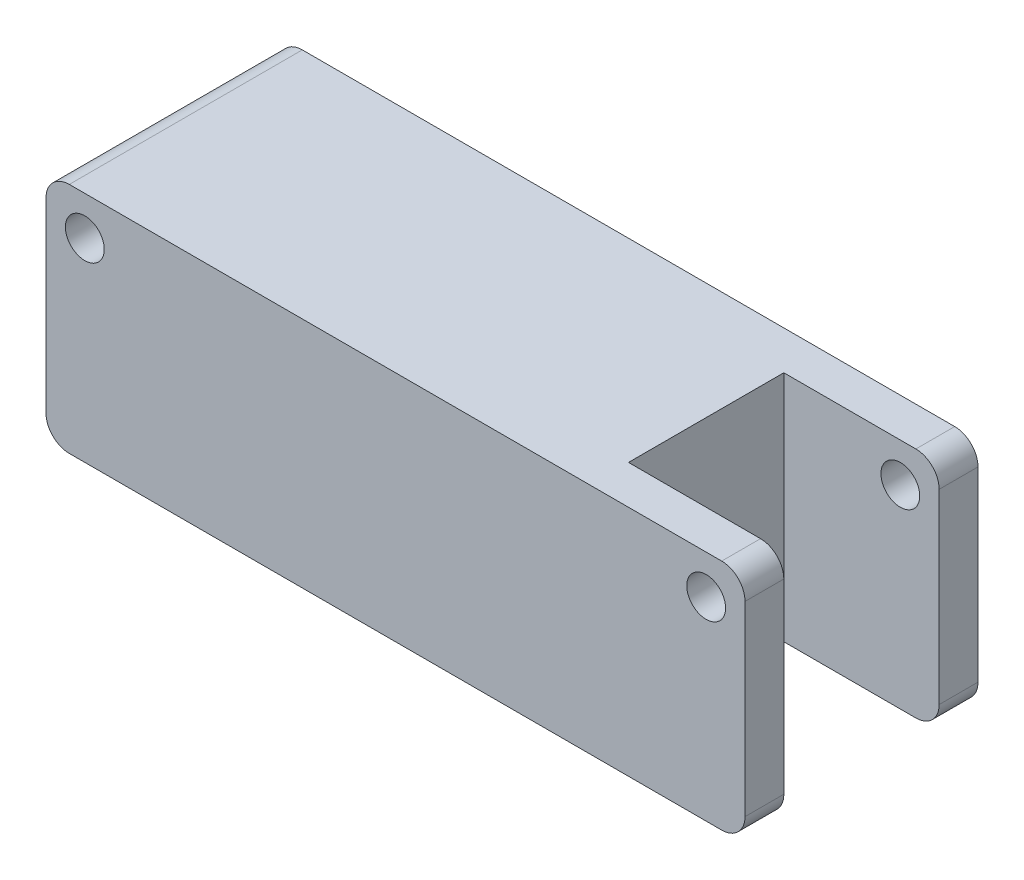
ISO-10303-21;
HEADER;
FILE_DESCRIPTION(('STEP AP214'),'2;1');
FILE_NAME('part.step','',(''),(''),'','','');
FILE_SCHEMA(('AUTOMOTIVE_DESIGN { 1 0 10303 214 1 1 1 1 }'));
ENDSEC;
DATA;
#1=APPLICATION_CONTEXT('core data for automotive mechanical design processes');
#2=APPLICATION_PROTOCOL_DEFINITION('international standard','automotive_design',2000,#1);
#3=PRODUCT_CONTEXT('',#1,'mechanical');
#4=PRODUCT('Part','Part','',(#3));
#5=PRODUCT_RELATED_PRODUCT_CATEGORY('part','',(#4));
#6=PRODUCT_DEFINITION_FORMATION('','',#4);
#7=PRODUCT_DEFINITION_CONTEXT('part definition',#1,'design');
#8=PRODUCT_DEFINITION('design','',#6,#7);
#9=PRODUCT_DEFINITION_SHAPE('','',#8);
#10=(LENGTH_UNIT() NAMED_UNIT(*) SI_UNIT(.MILLI.,.METRE.));
#11=(NAMED_UNIT(*) PLANE_ANGLE_UNIT() SI_UNIT($,.RADIAN.));
#12=(NAMED_UNIT(*) SI_UNIT($,.STERADIAN.) SOLID_ANGLE_UNIT());
#13=UNCERTAINTY_MEASURE_WITH_UNIT(LENGTH_MEASURE(1.E-05),#10,'distance_accuracy_value','');
#14=(GEOMETRIC_REPRESENTATION_CONTEXT(3) GLOBAL_UNCERTAINTY_ASSIGNED_CONTEXT((#13)) GLOBAL_UNIT_ASSIGNED_CONTEXT((#10,
#11,#12)) REPRESENTATION_CONTEXT('',''));
#15=CARTESIAN_POINT('',(0.,0.,0.));
#16=DIRECTION('',(0.,0.,1.));
#17=DIRECTION('',(1.,0.,0.));
#18=AXIS2_PLACEMENT_3D('',#15,#16,#17);
#19=CARTESIAN_POINT('',(90.,15.,15.));
#20=DIRECTION('',(-1.,0.,0.));
#21=DIRECTION('',(0.,0.,1.));
#22=AXIS2_PLACEMENT_3D('',#19,#20,#21);
#23=PLANE('',#22);
#24=DIRECTION('',(0.,0.,-1.));
#25=VECTOR('',#24,1.);
#26=CARTESIAN_POINT('',(90.,12.,15.));
#27=LINE('',#26,#25);
#28=CARTESIAN_POINT('',(90.,12.,-15.));
#29=VERTEX_POINT('',#28);
#30=CARTESIAN_POINT('',(90.,12.,-10.));
#31=VERTEX_POINT('',#30);
#32=EDGE_CURVE('E226',#29,#31,#27,.F.);
#33=ORIENTED_EDGE('',*,*,#32,.T.);
#34=DIRECTION('',(0.,1.,0.));
#35=VECTOR('',#34,1.);
#36=CARTESIAN_POINT('',(90.,-15.,-10.));
#37=LINE('',#36,#35);
#38=CARTESIAN_POINT('',(90.,-12.,-10.));
#39=VERTEX_POINT('',#38);
#40=EDGE_CURVE('E174',#39,#31,#37,.T.);
#41=ORIENTED_EDGE('',*,*,#40,.F.);
#42=DIRECTION('',(0.,0.,-1.));
#43=VECTOR('',#42,1.);
#44=CARTESIAN_POINT('',(90.,-12.,-15.));
#45=LINE('',#44,#43);
#46=CARTESIAN_POINT('',(90.,-12.,-15.));
#47=VERTEX_POINT('',#46);
#48=EDGE_CURVE('E221',#39,#47,#45,.T.);
#49=ORIENTED_EDGE('',*,*,#48,.T.);
#50=DIRECTION('',(0.,-1.,0.));
#51=VECTOR('',#50,1.);
#52=CARTESIAN_POINT('',(90.,15.,-15.));
#53=LINE('',#52,#51);
#54=EDGE_CURVE('E197',#29,#47,#53,.T.);
#55=ORIENTED_EDGE('',*,*,#54,.F.);
#56=EDGE_LOOP('',(#33,#41,#49,#55));
#57=FACE_BOUND('',#56,.T.);
#58=ADVANCED_FACE('F36',(#57),#23,.F.);
#59=CARTESIAN_POINT('',(87.,12.,0.));
#60=DIRECTION('',(0.,0.,-1.));
#61=DIRECTION('',(-1.,0.,0.));
#62=AXIS2_PLACEMENT_3D('',#59,#60,#61);
#63=CYLINDRICAL_SURFACE('',#62,3.);
#64=CARTESIAN_POINT('',(87.,12.,-10.));
#65=DIRECTION('',(0.,0.,-1.));
#66=DIRECTION('',(-1.,0.,0.));
#67=AXIS2_PLACEMENT_3D('',#64,#65,#66);
#68=CIRCLE('',#67,3.);
#69=CARTESIAN_POINT('',(87.,15.,-10.));
#70=VERTEX_POINT('',#69);
#71=EDGE_CURVE('E180',#31,#70,#68,.F.);
#72=ORIENTED_EDGE('',*,*,#71,.F.);
#73=ORIENTED_EDGE('',*,*,#32,.F.);
#74=CARTESIAN_POINT('',(87.,12.,-15.));
#75=DIRECTION('',(0.,0.,1.));
#76=DIRECTION('',(1.,0.,0.));
#77=AXIS2_PLACEMENT_3D('',#74,#75,#76);
#78=CIRCLE('',#77,3.);
#79=CARTESIAN_POINT('',(87.,15.,-15.));
#80=VERTEX_POINT('',#79);
#81=EDGE_CURVE('E219',#80,#29,#78,.F.);
#82=ORIENTED_EDGE('',*,*,#81,.F.);
#83=DIRECTION('',(0.,0.,-1.));
#84=VECTOR('',#83,1.);
#85=CARTESIAN_POINT('',(87.,15.,0.));
#86=LINE('',#85,#84);
#87=EDGE_CURVE('E209',#70,#80,#86,.T.);
#88=ORIENTED_EDGE('',*,*,#87,.F.);
#89=EDGE_LOOP('',(#72,#73,#82,#88));
#90=FACE_BOUND('',#89,.T.);
#91=ADVANCED_FACE('F290',(#90),#63,.T.);
#92=CARTESIAN_POINT('',(87.,-12.,15.));
#93=DIRECTION('',(0.,0.,1.));
#94=DIRECTION('',(1.,0.,0.));
#95=AXIS2_PLACEMENT_3D('',#92,#93,#94);
#96=CYLINDRICAL_SURFACE('',#95,3.);
#97=CARTESIAN_POINT('',(87.,-12.,-10.));
#98=DIRECTION('',(0.,0.,-1.));
#99=DIRECTION('',(-1.,0.,0.));
#100=AXIS2_PLACEMENT_3D('',#97,#98,#99);
#101=CIRCLE('',#100,3.);
#102=CARTESIAN_POINT('',(87.,-15.,-10.));
#103=VERTEX_POINT('',#102);
#104=EDGE_CURVE('E11',#103,#39,#101,.F.);
#105=ORIENTED_EDGE('',*,*,#104,.F.);
#106=DIRECTION('',(0.,0.,-1.));
#107=VECTOR('',#106,1.);
#108=CARTESIAN_POINT('',(87.,-15.,15.));
#109=LINE('',#108,#107);
#110=CARTESIAN_POINT('',(87.,-15.,-15.));
#111=VERTEX_POINT('',#110);
#112=EDGE_CURVE('E162',#111,#103,#109,.F.);
#113=ORIENTED_EDGE('',*,*,#112,.F.);
#114=CARTESIAN_POINT('',(87.,-12.,-15.));
#115=DIRECTION('',(0.,0.,1.));
#116=DIRECTION('',(1.,0.,0.));
#117=AXIS2_PLACEMENT_3D('',#114,#115,#116);
#118=CIRCLE('',#117,3.);
#119=EDGE_CURVE('E217',#47,#111,#118,.F.);
#120=ORIENTED_EDGE('',*,*,#119,.F.);
#121=ORIENTED_EDGE('',*,*,#48,.F.);
#122=EDGE_LOOP('',(#105,#113,#120,#121));
#123=FACE_BOUND('',#122,.T.);
#124=ADVANCED_FACE('F281',(#123),#96,.T.);
#125=CARTESIAN_POINT('',(0.,15.,15.));
#126=DIRECTION('',(1.,0.,0.));
#127=DIRECTION('',(0.,0.,-1.));
#128=AXIS2_PLACEMENT_3D('',#125,#126,#127);
#129=PLANE('',#128);
#130=DIRECTION('',(0.,-1.,0.));
#131=VECTOR('',#130,1.);
#132=CARTESIAN_POINT('',(0.,15.,-15.));
#133=LINE('',#132,#131);
#134=CARTESIAN_POINT('',(0.,12.,-15.));
#135=VERTEX_POINT('',#134);
#136=CARTESIAN_POINT('',(0.,-12.,-15.));
#137=VERTEX_POINT('',#136);
#138=EDGE_CURVE('E190',#135,#137,#133,.T.);
#139=ORIENTED_EDGE('',*,*,#138,.T.);
#140=DIRECTION('',(0.,0.,1.));
#141=VECTOR('',#140,1.);
#142=CARTESIAN_POINT('',(0.,-12.,15.));
#143=LINE('',#142,#141);
#144=CARTESIAN_POINT('',(0.,-12.,15.));
#145=VERTEX_POINT('',#144);
#146=EDGE_CURVE('E242',#137,#145,#143,.T.);
#147=ORIENTED_EDGE('',*,*,#146,.T.);
#148=DIRECTION('',(0.,-1.,0.));
#149=VECTOR('',#148,1.);
#150=CARTESIAN_POINT('',(0.,15.,15.));
#151=LINE('',#150,#149);
#152=CARTESIAN_POINT('',(0.,12.,15.));
#153=VERTEX_POINT('',#152);
#154=EDGE_CURVE('E203',#153,#145,#151,.T.);
#155=ORIENTED_EDGE('',*,*,#154,.F.);
#156=DIRECTION('',(0.,0.,1.));
#157=VECTOR('',#156,1.);
#158=CARTESIAN_POINT('',(0.,12.,15.));
#159=LINE('',#158,#157);
#160=EDGE_CURVE('E240',#153,#135,#159,.F.);
#161=ORIENTED_EDGE('',*,*,#160,.T.);
#162=EDGE_LOOP('',(#139,#147,#155,#161));
#163=FACE_BOUND('',#162,.T.);
#164=ADVANCED_FACE('F273',(#163),#129,.F.);
#165=CARTESIAN_POINT('',(0.,15.,15.));
#166=DIRECTION('',(0.,0.,-1.));
#167=DIRECTION('',(-1.,0.,0.));
#168=AXIS2_PLACEMENT_3D('',#165,#166,#167);
#169=PLANE('',#168);
#170=CARTESIAN_POINT('',(85.,10.,15.));
#171=DIRECTION('',(0.,0.,-1.));
#172=DIRECTION('',(-1.,0.,0.));
#173=AXIS2_PLACEMENT_3D('',#170,#171,#172);
#174=CIRCLE('',#173,2.5);
#175=CARTESIAN_POINT('',(82.5,10.,15.));
#176=VERTEX_POINT('',#175);
#177=EDGE_CURVE('E415',#176,#176,#174,.T.);
#178=ORIENTED_EDGE('',*,*,#177,.T.);
#179=EDGE_LOOP('',(#178));
#180=FACE_BOUND('',#179,.T.);
#181=CARTESIAN_POINT('',(5.,10.,15.));
#182=DIRECTION('',(0.,0.,-1.));
#183=DIRECTION('',(1.,0.,0.));
#184=AXIS2_PLACEMENT_3D('',#181,#182,#183);
#185=CIRCLE('',#184,2.5);
#186=CARTESIAN_POINT('',(7.5,10.,15.));
#187=VERTEX_POINT('',#186);
#188=EDGE_CURVE('E422',#187,#187,#185,.T.);
#189=ORIENTED_EDGE('',*,*,#188,.T.);
#190=EDGE_LOOP('',(#189));
#191=FACE_BOUND('',#190,.T.);
#192=DIRECTION('',(0.,-1.,0.));
#193=VECTOR('',#192,1.);
#194=CARTESIAN_POINT('',(90.,15.,15.));
#195=LINE('',#194,#193);
#196=CARTESIAN_POINT('',(90.,12.,15.));
#197=VERTEX_POINT('',#196);
#198=CARTESIAN_POINT('',(90.,-12.,15.));
#199=VERTEX_POINT('',#198);
#200=EDGE_CURVE('E200',#197,#199,#195,.T.);
#201=ORIENTED_EDGE('',*,*,#200,.F.);
#202=CARTESIAN_POINT('',(87.,12.,15.));
#203=DIRECTION('',(0.,0.,-1.));
#204=DIRECTION('',(-1.,0.,0.));
#205=AXIS2_PLACEMENT_3D('',#202,#203,#204);
#206=CIRCLE('',#205,3.);
#207=CARTESIAN_POINT('',(87.,15.,15.));
#208=VERTEX_POINT('',#207);
#209=EDGE_CURVE('E234',#197,#208,#206,.F.);
#210=ORIENTED_EDGE('',*,*,#209,.T.);
#211=DIRECTION('',(1.,0.,0.));
#212=VECTOR('',#211,1.);
#213=CARTESIAN_POINT('',(0.,15.,15.));
#214=LINE('',#213,#212);
#215=CARTESIAN_POINT('',(3.,15.,15.));
#216=VERTEX_POINT('',#215);
#217=EDGE_CURVE('E183',#216,#208,#214,.T.);
#218=ORIENTED_EDGE('',*,*,#217,.F.);
#219=CARTESIAN_POINT('',(3.,12.,15.));
#220=DIRECTION('',(0.,0.,-1.));
#221=DIRECTION('',(-1.,0.,0.));
#222=AXIS2_PLACEMENT_3D('',#219,#220,#221);
#223=CIRCLE('',#222,3.);
#224=EDGE_CURVE('E229',#216,#153,#223,.F.);
#225=ORIENTED_EDGE('',*,*,#224,.T.);
#226=ORIENTED_EDGE('',*,*,#154,.T.);
#227=CARTESIAN_POINT('',(3.,-12.,15.));
#228=DIRECTION('',(0.,0.,-1.));
#229=DIRECTION('',(-1.,0.,0.));
#230=AXIS2_PLACEMENT_3D('',#227,#228,#229);
#231=CIRCLE('',#230,3.);
#232=CARTESIAN_POINT('',(3.,-15.,15.));
#233=VERTEX_POINT('',#232);
#234=EDGE_CURVE('E60',#145,#233,#231,.F.);
#235=ORIENTED_EDGE('',*,*,#234,.T.);
#236=DIRECTION('',(1.,0.,0.));
#237=VECTOR('',#236,1.);
#238=CARTESIAN_POINT('',(0.,-15.,15.));
#239=LINE('',#238,#237);
#240=CARTESIAN_POINT('',(87.,-15.,15.));
#241=VERTEX_POINT('',#240);
#242=EDGE_CURVE('E182',#233,#241,#239,.T.);
#243=ORIENTED_EDGE('',*,*,#242,.T.);
#244=CARTESIAN_POINT('',(87.,-12.,15.));
#245=DIRECTION('',(0.,0.,-1.));
#246=DIRECTION('',(-1.,0.,0.));
#247=AXIS2_PLACEMENT_3D('',#244,#245,#246);
#248=CIRCLE('',#247,3.);
#249=EDGE_CURVE('E232',#241,#199,#248,.F.);
#250=ORIENTED_EDGE('',*,*,#249,.T.);
#251=EDGE_LOOP('',(#201,#210,#218,#225,#226,#235,#243,#250));
#252=FACE_BOUND('',#251,.T.);
#253=ADVANCED_FACE('F253',(#180,#191,#252),#169,.F.);
#254=CARTESIAN_POINT('',(90.,-12.,10.));
#255=VERTEX_POINT('',#254);
#256=EDGE_CURVE('E222',#199,#255,#45,.T.);
#257=ORIENTED_EDGE('',*,*,#256,.T.);
#258=DIRECTION('',(0.,1.,0.));
#259=VECTOR('',#258,1.);
#260=CARTESIAN_POINT('',(90.,-15.,10.));
#261=LINE('',#260,#259);
#262=CARTESIAN_POINT('',(90.,12.,10.));
#263=VERTEX_POINT('',#262);
#264=EDGE_CURVE('E52',#255,#263,#261,.T.);
#265=ORIENTED_EDGE('',*,*,#264,.T.);
#266=EDGE_CURVE('E225',#263,#197,#27,.F.);
#267=ORIENTED_EDGE('',*,*,#266,.T.);
#268=ORIENTED_EDGE('',*,*,#200,.T.);
#269=EDGE_LOOP('',(#257,#265,#267,#268));
#270=FACE_BOUND('',#269,.T.);
#271=ADVANCED_FACE('F256',(#270),#23,.F.);
#272=CARTESIAN_POINT('',(0.,15.,-15.));
#273=DIRECTION('',(0.,0.,1.));
#274=DIRECTION('',(1.,0.,0.));
#275=AXIS2_PLACEMENT_3D('',#272,#273,#274);
#276=PLANE('',#275);
#277=CARTESIAN_POINT('',(85.,10.,-15.));
#278=DIRECTION('',(0.,0.,-1.));
#279=DIRECTION('',(-1.,0.,0.));
#280=AXIS2_PLACEMENT_3D('',#277,#278,#279);
#281=CIRCLE('',#280,2.5);
#282=CARTESIAN_POINT('',(82.5,10.,-15.));
#283=VERTEX_POINT('',#282);
#284=EDGE_CURVE('E418',#283,#283,#281,.T.);
#285=ORIENTED_EDGE('',*,*,#284,.F.);
#286=EDGE_LOOP('',(#285));
#287=FACE_BOUND('',#286,.T.);
#288=CARTESIAN_POINT('',(5.,10.,-15.));
#289=DIRECTION('',(0.,0.,-1.));
#290=DIRECTION('',(1.,0.,0.));
#291=AXIS2_PLACEMENT_3D('',#288,#289,#290);
#292=CIRCLE('',#291,2.5);
#293=CARTESIAN_POINT('',(7.5,10.,-15.));
#294=VERTEX_POINT('',#293);
#295=EDGE_CURVE('E426',#294,#294,#292,.T.);
#296=ORIENTED_EDGE('',*,*,#295,.F.);
#297=EDGE_LOOP('',(#296));
#298=FACE_BOUND('',#297,.T.);
#299=DIRECTION('',(-1.,0.,0.));
#300=VECTOR('',#299,1.);
#301=CARTESIAN_POINT('',(0.,15.,-15.));
#302=LINE('',#301,#300);
#303=CARTESIAN_POINT('',(3.,15.,-15.));
#304=VERTEX_POINT('',#303);
#305=EDGE_CURVE('E186',#80,#304,#302,.T.);
#306=ORIENTED_EDGE('',*,*,#305,.F.);
#307=ORIENTED_EDGE('',*,*,#81,.T.);
#308=ORIENTED_EDGE('',*,*,#54,.T.);
#309=ORIENTED_EDGE('',*,*,#119,.T.);
#310=DIRECTION('',(-1.,0.,0.));
#311=VECTOR('',#310,1.);
#312=CARTESIAN_POINT('',(0.,-15.,-15.));
#313=LINE('',#312,#311);
#314=CARTESIAN_POINT('',(3.,-15.,-15.));
#315=VERTEX_POINT('',#314);
#316=EDGE_CURVE('E187',#111,#315,#313,.T.);
#317=ORIENTED_EDGE('',*,*,#316,.T.);
#318=CARTESIAN_POINT('',(3.,-12.,-15.));
#319=DIRECTION('',(0.,0.,1.));
#320=DIRECTION('',(1.,0.,0.));
#321=AXIS2_PLACEMENT_3D('',#318,#319,#320);
#322=CIRCLE('',#321,3.);
#323=EDGE_CURVE('E215',#315,#137,#322,.F.);
#324=ORIENTED_EDGE('',*,*,#323,.T.);
#325=ORIENTED_EDGE('',*,*,#138,.F.);
#326=CARTESIAN_POINT('',(3.,12.,-15.));
#327=DIRECTION('',(0.,0.,1.));
#328=DIRECTION('',(1.,0.,0.));
#329=AXIS2_PLACEMENT_3D('',#326,#327,#328);
#330=CIRCLE('',#329,3.);
#331=EDGE_CURVE('E213',#135,#304,#330,.F.);
#332=ORIENTED_EDGE('',*,*,#331,.T.);
#333=EDGE_LOOP('',(#306,#307,#308,#309,#317,#324,#325,#332));
#334=FACE_BOUND('',#333,.T.);
#335=ADVANCED_FACE('F278',(#287,#298,#334),#276,.F.);
#336=CARTESIAN_POINT('',(0.,15.,0.));
#337=DIRECTION('',(0.,-1.,0.));
#338=DIRECTION('',(0.,0.,-1.));
#339=AXIS2_PLACEMENT_3D('',#336,#337,#338);
#340=PLANE('',#339);
#341=DIRECTION('',(0.,0.,1.));
#342=VECTOR('',#341,1.);
#343=CARTESIAN_POINT('',(70.,15.,10.));
#344=LINE('',#343,#342);
#345=CARTESIAN_POINT('',(70.,15.,-10.));
#346=VERTEX_POINT('',#345);
#347=CARTESIAN_POINT('',(70.,15.,10.));
#348=VERTEX_POINT('',#347);
#349=EDGE_CURVE('E165',#346,#348,#344,.T.);
#350=ORIENTED_EDGE('',*,*,#349,.F.);
#351=DIRECTION('',(-1.,0.,0.));
#352=VECTOR('',#351,1.);
#353=CARTESIAN_POINT('',(70.,15.,-10.));
#354=LINE('',#353,#352);
#355=EDGE_CURVE('E144',#70,#346,#354,.T.);
#356=ORIENTED_EDGE('',*,*,#355,.F.);
#357=ORIENTED_EDGE('',*,*,#87,.T.);
#358=ORIENTED_EDGE('',*,*,#305,.T.);
#359=DIRECTION('',(0.,0.,1.));
#360=VECTOR('',#359,1.);
#361=CARTESIAN_POINT('',(3.,15.,0.));
#362=LINE('',#361,#360);
#363=EDGE_CURVE('E206',#304,#216,#362,.T.);
#364=ORIENTED_EDGE('',*,*,#363,.T.);
#365=ORIENTED_EDGE('',*,*,#217,.T.);
#366=CARTESIAN_POINT('',(87.,15.,10.));
#367=VERTEX_POINT('',#366);
#368=EDGE_CURVE('E210',#208,#367,#86,.T.);
#369=ORIENTED_EDGE('',*,*,#368,.T.);
#370=DIRECTION('',(1.,0.,0.));
#371=VECTOR('',#370,1.);
#372=CARTESIAN_POINT('',(90.,15.,10.));
#373=LINE('',#372,#371);
#374=EDGE_CURVE('E163',#348,#367,#373,.T.);
#375=ORIENTED_EDGE('',*,*,#374,.F.);
#376=EDGE_LOOP('',(#350,#356,#357,#358,#364,#365,#369,#375));
#377=FACE_BOUND('',#376,.T.);
#378=ADVANCED_FACE('F264',(#377),#340,.F.);
#379=CARTESIAN_POINT('',(0.,-15.,0.));
#380=DIRECTION('',(0.,-1.,0.));
#381=DIRECTION('',(0.,0.,-1.));
#382=AXIS2_PLACEMENT_3D('',#379,#380,#381);
#383=PLANE('',#382);
#384=DIRECTION('',(-1.,0.,0.));
#385=VECTOR('',#384,1.);
#386=CARTESIAN_POINT('',(70.,-15.,-10.));
#387=LINE('',#386,#385);
#388=CARTESIAN_POINT('',(70.,-15.,-10.));
#389=VERTEX_POINT('',#388);
#390=EDGE_CURVE('E141',#103,#389,#387,.T.);
#391=ORIENTED_EDGE('',*,*,#390,.T.);
#392=DIRECTION('',(0.,0.,1.));
#393=VECTOR('',#392,1.);
#394=CARTESIAN_POINT('',(70.,-15.,10.));
#395=LINE('',#394,#393);
#396=CARTESIAN_POINT('',(70.,-15.,10.));
#397=VERTEX_POINT('',#396);
#398=EDGE_CURVE('E152',#389,#397,#395,.T.);
#399=ORIENTED_EDGE('',*,*,#398,.T.);
#400=DIRECTION('',(1.,0.,0.));
#401=VECTOR('',#400,1.);
#402=CARTESIAN_POINT('',(90.,-15.,10.));
#403=LINE('',#402,#401);
#404=CARTESIAN_POINT('',(87.,-15.,10.));
#405=VERTEX_POINT('',#404);
#406=EDGE_CURVE('E149',#397,#405,#403,.T.);
#407=ORIENTED_EDGE('',*,*,#406,.T.);
#408=EDGE_CURVE('E238',#405,#241,#109,.F.);
#409=ORIENTED_EDGE('',*,*,#408,.T.);
#410=ORIENTED_EDGE('',*,*,#242,.F.);
#411=DIRECTION('',(0.,0.,1.));
#412=VECTOR('',#411,1.);
#413=CARTESIAN_POINT('',(3.,-15.,-15.));
#414=LINE('',#413,#412);
#415=EDGE_CURVE('E236',#233,#315,#414,.F.);
#416=ORIENTED_EDGE('',*,*,#415,.T.);
#417=ORIENTED_EDGE('',*,*,#316,.F.);
#418=ORIENTED_EDGE('',*,*,#112,.T.);
#419=EDGE_LOOP('',(#391,#399,#407,#409,#410,#416,#417,#418));
#420=FACE_BOUND('',#419,.T.);
#421=ADVANCED_FACE('F159',(#420),#383,.T.);
#422=CARTESIAN_POINT('',(87.,12.,10.));
#423=DIRECTION('',(0.,0.,1.));
#424=DIRECTION('',(1.,0.,0.));
#425=AXIS2_PLACEMENT_3D('',#422,#423,#424);
#426=CIRCLE('',#425,3.);
#427=EDGE_CURVE('E176',#367,#263,#426,.F.);
#428=ORIENTED_EDGE('',*,*,#427,.F.);
#429=ORIENTED_EDGE('',*,*,#368,.F.);
#430=ORIENTED_EDGE('',*,*,#209,.F.);
#431=ORIENTED_EDGE('',*,*,#266,.F.);
#432=EDGE_LOOP('',(#428,#429,#430,#431));
#433=FACE_BOUND('',#432,.T.);
#434=ADVANCED_FACE('F260',(#433),#63,.T.);
#435=CARTESIAN_POINT('',(87.,-12.,10.));
#436=DIRECTION('',(0.,0.,1.));
#437=DIRECTION('',(1.,0.,0.));
#438=AXIS2_PLACEMENT_3D('',#435,#436,#437);
#439=CIRCLE('',#438,3.);
#440=EDGE_CURVE('E45',#255,#405,#439,.F.);
#441=ORIENTED_EDGE('',*,*,#440,.F.);
#442=ORIENTED_EDGE('',*,*,#256,.F.);
#443=ORIENTED_EDGE('',*,*,#249,.F.);
#444=ORIENTED_EDGE('',*,*,#408,.F.);
#445=EDGE_LOOP('',(#441,#442,#443,#444));
#446=FACE_BOUND('',#445,.T.);
#447=ADVANCED_FACE('F250',(#446),#96,.T.);
#448=CARTESIAN_POINT('',(3.,-12.,15.));
#449=DIRECTION('',(0.,0.,-1.));
#450=DIRECTION('',(-1.,0.,0.));
#451=AXIS2_PLACEMENT_3D('',#448,#449,#450);
#452=CYLINDRICAL_SURFACE('',#451,3.);
#453=ORIENTED_EDGE('',*,*,#323,.F.);
#454=ORIENTED_EDGE('',*,*,#415,.F.);
#455=ORIENTED_EDGE('',*,*,#234,.F.);
#456=ORIENTED_EDGE('',*,*,#146,.F.);
#457=EDGE_LOOP('',(#453,#454,#455,#456));
#458=FACE_BOUND('',#457,.T.);
#459=ADVANCED_FACE('F276',(#458),#452,.T.);
#460=CARTESIAN_POINT('',(3.,12.,0.));
#461=DIRECTION('',(0.,0.,1.));
#462=DIRECTION('',(1.,0.,0.));
#463=AXIS2_PLACEMENT_3D('',#460,#461,#462);
#464=CYLINDRICAL_SURFACE('',#463,3.);
#465=ORIENTED_EDGE('',*,*,#331,.F.);
#466=ORIENTED_EDGE('',*,*,#160,.F.);
#467=ORIENTED_EDGE('',*,*,#224,.F.);
#468=ORIENTED_EDGE('',*,*,#363,.F.);
#469=EDGE_LOOP('',(#465,#466,#467,#468));
#470=FACE_BOUND('',#469,.T.);
#471=ADVANCED_FACE('F38',(#470),#464,.T.);
#472=CARTESIAN_POINT('',(70.,-15.,-10.));
#473=DIRECTION('',(0.,0.,-1.));
#474=DIRECTION('',(-1.,0.,0.));
#475=AXIS2_PLACEMENT_3D('',#472,#473,#474);
#476=PLANE('',#475);
#477=CARTESIAN_POINT('',(85.,10.,-10.));
#478=DIRECTION('',(0.,0.,-1.));
#479=DIRECTION('',(-1.,0.,0.));
#480=AXIS2_PLACEMENT_3D('',#477,#478,#479);
#481=CIRCLE('',#480,2.5);
#482=CARTESIAN_POINT('',(82.5,10.,-10.));
#483=VERTEX_POINT('',#482);
#484=EDGE_CURVE('E168',#483,#483,#481,.T.);
#485=ORIENTED_EDGE('',*,*,#484,.T.);
#486=EDGE_LOOP('',(#485));
#487=FACE_BOUND('',#486,.T.);
#488=ORIENTED_EDGE('',*,*,#71,.T.);
#489=ORIENTED_EDGE('',*,*,#355,.T.);
#490=DIRECTION('',(0.,1.,0.));
#491=VECTOR('',#490,1.);
#492=CARTESIAN_POINT('',(70.,-15.,-10.));
#493=LINE('',#492,#491);
#494=EDGE_CURVE('E137',#389,#346,#493,.T.);
#495=ORIENTED_EDGE('',*,*,#494,.F.);
#496=ORIENTED_EDGE('',*,*,#390,.F.);
#497=ORIENTED_EDGE('',*,*,#104,.T.);
#498=ORIENTED_EDGE('',*,*,#40,.T.);
#499=EDGE_LOOP('',(#488,#489,#495,#496,#497,#498));
#500=FACE_BOUND('',#499,.T.);
#501=ADVANCED_FACE('F139',(#487,#500),#476,.F.);
#502=CARTESIAN_POINT('',(90.,-15.,10.));
#503=DIRECTION('',(0.,0.,1.));
#504=DIRECTION('',(1.,0.,0.));
#505=AXIS2_PLACEMENT_3D('',#502,#503,#504);
#506=PLANE('',#505);
#507=CARTESIAN_POINT('',(85.,10.,10.));
#508=DIRECTION('',(0.,0.,1.));
#509=DIRECTION('',(1.,0.,0.));
#510=AXIS2_PLACEMENT_3D('',#507,#508,#509);
#511=CIRCLE('',#510,2.5);
#512=CARTESIAN_POINT('',(87.5,10.,10.));
#513=VERTEX_POINT('',#512);
#514=EDGE_CURVE('E40',#513,#513,#511,.T.);
#515=ORIENTED_EDGE('',*,*,#514,.T.);
#516=EDGE_LOOP('',(#515));
#517=FACE_BOUND('',#516,.T.);
#518=ORIENTED_EDGE('',*,*,#427,.T.);
#519=ORIENTED_EDGE('',*,*,#264,.F.);
#520=ORIENTED_EDGE('',*,*,#440,.T.);
#521=ORIENTED_EDGE('',*,*,#406,.F.);
#522=DIRECTION('',(0.,1.,0.));
#523=VECTOR('',#522,1.);
#524=CARTESIAN_POINT('',(70.,-15.,10.));
#525=LINE('',#524,#523);
#526=EDGE_CURVE('E148',#397,#348,#525,.T.);
#527=ORIENTED_EDGE('',*,*,#526,.T.);
#528=ORIENTED_EDGE('',*,*,#374,.T.);
#529=EDGE_LOOP('',(#518,#519,#520,#521,#527,#528));
#530=FACE_BOUND('',#529,.T.);
#531=ADVANCED_FACE('F244',(#517,#530),#506,.F.);
#532=CARTESIAN_POINT('',(70.,-15.,10.));
#533=DIRECTION('',(-1.,0.,0.));
#534=DIRECTION('',(0.,0.,1.));
#535=AXIS2_PLACEMENT_3D('',#532,#533,#534);
#536=PLANE('',#535);
#537=ORIENTED_EDGE('',*,*,#349,.T.);
#538=ORIENTED_EDGE('',*,*,#526,.F.);
#539=ORIENTED_EDGE('',*,*,#398,.F.);
#540=ORIENTED_EDGE('',*,*,#494,.T.);
#541=EDGE_LOOP('',(#537,#538,#539,#540));
#542=FACE_BOUND('',#541,.T.);
#543=ADVANCED_FACE('F153',(#542),#536,.F.);
#544=CARTESIAN_POINT('',(85.,10.,15.));
#545=DIRECTION('',(0.,0.,-1.));
#546=DIRECTION('',(-1.,0.,0.));
#547=AXIS2_PLACEMENT_3D('',#544,#545,#546);
#548=CYLINDRICAL_SURFACE('',#547,2.5);
#549=ORIENTED_EDGE('',*,*,#177,.F.);
#550=EDGE_LOOP('',(#549));
#551=FACE_BOUND('',#550,.T.);
#552=ORIENTED_EDGE('',*,*,#514,.F.);
#553=EDGE_LOOP('',(#552));
#554=FACE_BOUND('',#553,.T.);
#555=ADVANCED_FACE('F366',(#551,#554),#548,.F.);
#556=ORIENTED_EDGE('',*,*,#284,.T.);
#557=EDGE_LOOP('',(#556));
#558=FACE_BOUND('',#557,.T.);
#559=ORIENTED_EDGE('',*,*,#484,.F.);
#560=EDGE_LOOP('',(#559));
#561=FACE_BOUND('',#560,.T.);
#562=ADVANCED_FACE('F381',(#558,#561),#548,.F.);
#563=CARTESIAN_POINT('',(5.,10.,15.));
#564=DIRECTION('',(0.,0.,-1.));
#565=DIRECTION('',(-1.,0.,0.));
#566=AXIS2_PLACEMENT_3D('',#563,#564,#565);
#567=CYLINDRICAL_SURFACE('',#566,2.5);
#568=ORIENTED_EDGE('',*,*,#188,.F.);
#569=EDGE_LOOP('',(#568));
#570=FACE_BOUND('',#569,.T.);
#571=ORIENTED_EDGE('',*,*,#295,.T.);
#572=EDGE_LOOP('',(#571));
#573=FACE_BOUND('',#572,.T.);
#574=ADVANCED_FACE('F388',(#570,#573),#567,.F.);
#575=CLOSED_SHELL('',(#58,#91,#124,#164,#253,#271,#335,#378,#421,#434,#447,#459,#471,#501,#531,
#543,#555,#562,#574));
#576=MANIFOLD_SOLID_BREP('B2',#575);
#577=ADVANCED_BREP_SHAPE_REPRESENTATION('',(#18,#576),#14);
#578=SHAPE_DEFINITION_REPRESENTATION(#9,#577);
ENDSEC;
END-ISO-10303-21;
